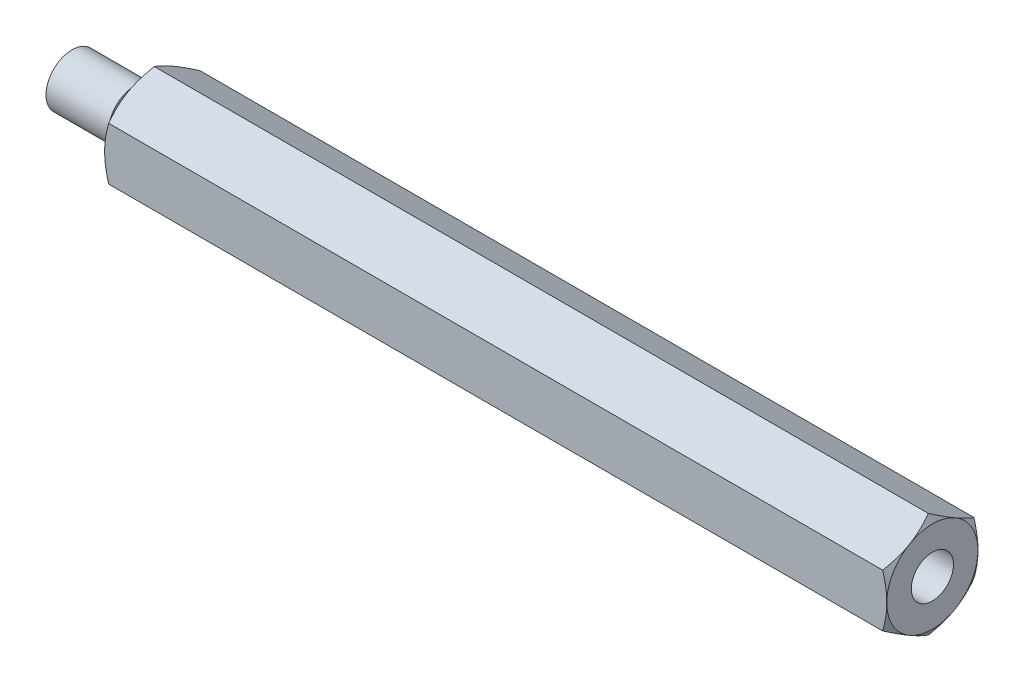
ISO-10303-21;
HEADER;
FILE_DESCRIPTION(('STEP AP214'),'2;1');
FILE_NAME('part.step','',(''),(''),'','','');
FILE_SCHEMA(('AUTOMOTIVE_DESIGN { 1 0 10303 214 1 1 1 1 }'));
ENDSEC;
DATA;
#1=APPLICATION_CONTEXT('core data for automotive mechanical design processes');
#2=APPLICATION_PROTOCOL_DEFINITION('international standard','automotive_design',2000,#1);
#3=PRODUCT_CONTEXT('',#1,'mechanical');
#4=PRODUCT('Part','Part','',(#3));
#5=PRODUCT_RELATED_PRODUCT_CATEGORY('part','',(#4));
#6=PRODUCT_DEFINITION_FORMATION('','',#4);
#7=PRODUCT_DEFINITION_CONTEXT('part definition',#1,'design');
#8=PRODUCT_DEFINITION('design','',#6,#7);
#9=PRODUCT_DEFINITION_SHAPE('','',#8);
#10=(LENGTH_UNIT() NAMED_UNIT(*) SI_UNIT(.MILLI.,.METRE.));
#11=(NAMED_UNIT(*) PLANE_ANGLE_UNIT() SI_UNIT($,.RADIAN.));
#12=(NAMED_UNIT(*) SI_UNIT($,.STERADIAN.) SOLID_ANGLE_UNIT());
#13=UNCERTAINTY_MEASURE_WITH_UNIT(LENGTH_MEASURE(1.E-05),#10,'distance_accuracy_value','');
#14=(GEOMETRIC_REPRESENTATION_CONTEXT(3) GLOBAL_UNCERTAINTY_ASSIGNED_CONTEXT((#13)) GLOBAL_UNIT_ASSIGNED_CONTEXT((#10,
#11,#12)) REPRESENTATION_CONTEXT('',''));
#15=CARTESIAN_POINT('',(0.,0.,0.));
#16=DIRECTION('',(0.,0.,1.));
#17=DIRECTION('',(1.,0.,0.));
#18=AXIS2_PLACEMENT_3D('',#15,#16,#17);
#19=CARTESIAN_POINT('',(60.,2.02072594216369,-3.5));
#20=DIRECTION('',(0.,-0.866025403784439,0.5));
#21=DIRECTION('',(0.,-0.5,-0.866025403784439));
#22=AXIS2_PLACEMENT_3D('',#19,#20,#21);
#23=PLANE('',#22);
#24=CARTESIAN_POINT('',(59.6873259393066,2.02061047210985,-3.5002));
#25=CARTESIAN_POINT('',(59.73861421101,2.10941108799267,-3.34639282154755));
#26=CARTESIAN_POINT('',(59.7852590461838,2.19897822522909,-3.19125798916558));
#27=CARTESIAN_POINT('',(59.8666781244667,2.37966345361545,-2.87830199342322));
#28=CARTESIAN_POINT('',(59.9014235644154,2.47078475532382,-2.72047526921251));
#29=CARTESIAN_POINT('',(59.9555099728172,2.65189807961073,-2.40677778961988));
#30=CARTESIAN_POINT('',(59.9752109137396,2.74186223545399,-2.25095530083931));
#31=CARTESIAN_POINT('',(59.9987298672627,2.92221386641055,-1.93857711279463));
#32=CARTESIAN_POINT('',(60.0025673554544,3.01260068598001,-1.78202254896578));
#33=CARTESIAN_POINT('',(59.994584698123,3.1814939814933,-1.48949078007902));
#34=CARTESIAN_POINT('',(59.9847245659304,3.26002573814993,-1.3534697875421));
#35=CARTESIAN_POINT('',(59.9534735331006,3.41657761679354,-1.08231397971101));
#36=CARTESIAN_POINT('',(59.9320719567142,3.49459719728457,-0.947180102315322));
#37=CARTESIAN_POINT('',(59.8785695921194,3.65147186489429,-0.675465207594819));
#38=CARTESIAN_POINT('',(59.8462420055549,3.73030709667644,-0.538918580721667));
#39=CARTESIAN_POINT('',(59.772871066192,3.88680174018324,-0.2678619070555));
#40=CARTESIAN_POINT('',(59.7318449534301,3.96446315689009,-0.133348387531464));
#41=CARTESIAN_POINT('',(59.6873259393066,4.04156735438122,0.000199999999999813));
#42=B_SPLINE_CURVE_WITH_KNOTS('',3,(#24,#25,#26,#27,#28,#29,#30,#31,#32,#33,#34,#35,#36,#37,#38,
#39,#40,#41),.UNSPECIFIED.,.F.,.F.,(4,2,2,2,2,2,2,2,4),(0.,0.554793832886251,1.11092123814983,
1.65328467083218,2.19498204478402,2.66665130850859,3.13875761298266,3.62133612600509,
4.10296698719187),.UNSPECIFIED.);
#43=CARTESIAN_POINT('',(59.6873926088304,2.0207259421637,-3.5));
#44=VERTEX_POINT('',#43);
#45=CARTESIAN_POINT('',(60.,3.03108891324554,-1.75));
#46=VERTEX_POINT('',#45);
#47=EDGE_CURVE('E331',#44,#46,#42,.T.);
#48=ORIENTED_EDGE('',*,*,#47,.F.);
#49=DIRECTION('',(-1.,0.,0.));
#50=VECTOR('',#49,1.);
#51=CARTESIAN_POINT('',(60.,2.02072594216369,-3.5));
#52=LINE('',#51,#50);
#53=CARTESIAN_POINT('',(0.312607391169639,2.0207259421637,-3.5));
#54=VERTEX_POINT('',#53);
#55=EDGE_CURVE('E265',#44,#54,#52,.T.);
#56=ORIENTED_EDGE('',*,*,#55,.T.);
#57=CARTESIAN_POINT('',(0.312674060693367,4.04156735438122,0.000199999999999298));
#58=CARTESIAN_POINT('',(0.26138578898998,3.9527667384984,-0.15360717845245));
#59=CARTESIAN_POINT('',(0.214740953816195,3.86319960126198,-0.308742010834424));
#60=CARTESIAN_POINT('',(0.133321875533347,3.68251437287562,-0.621698006576781));
#61=CARTESIAN_POINT('',(0.0985764355845602,3.59139307116725,-0.779524730787496));
#62=CARTESIAN_POINT('',(0.0444900271828355,3.41027974688034,-1.09322221038013));
#63=CARTESIAN_POINT('',(0.0247890862603813,3.32031559103708,-1.24904469916069));
#64=CARTESIAN_POINT('',(0.00127013273725456,3.13996396008052,-1.56142288720537));
#65=CARTESIAN_POINT('',(-0.00256735545443454,3.04957714051106,-1.71797745103423));
#66=CARTESIAN_POINT('',(0.00541530187697768,2.88068384499778,-2.01050921992099));
#67=CARTESIAN_POINT('',(0.0152754340696069,2.80215208834115,-2.1465302124579));
#68=CARTESIAN_POINT('',(0.0465264668994027,2.64560020969754,-2.41768602028899));
#69=CARTESIAN_POINT('',(0.0679280432857968,2.5675806292065,-2.55281989768468));
#70=CARTESIAN_POINT('',(0.121430407880575,2.41070596159679,-2.82453479240518));
#71=CARTESIAN_POINT('',(0.153757994445084,2.33187072981464,-2.96108141927833));
#72=CARTESIAN_POINT('',(0.227128933807991,2.17537608630783,-3.2321380929445));
#73=CARTESIAN_POINT('',(0.268155046569863,2.09771466960099,-3.36665161246854));
#74=CARTESIAN_POINT('',(0.312674060693366,2.02061047210985,-3.5002));
#75=B_SPLINE_CURVE_WITH_KNOTS('',3,(#57,#58,#59,#60,#61,#62,#63,#64,#65,#66,#67,#68,#69,#70,#71,
#72,#73,#74),.UNSPECIFIED.,.F.,.F.,(4,2,2,2,2,2,2,2,4),(0.,0.554793832886252,1.11092123814983,
1.65328467083218,2.19498204478403,2.6666513085086,3.13875761298267,3.62133612600509,
4.10296698719187),.UNSPECIFIED.);
#76=CARTESIAN_POINT('',(0.,3.03108891324554,-1.75));
#77=VERTEX_POINT('',#76);
#78=EDGE_CURVE('E315',#77,#54,#75,.T.);
#79=ORIENTED_EDGE('',*,*,#78,.F.);
#80=CARTESIAN_POINT('',(0.312607391169639,4.04145188432738,0.));
#81=VERTEX_POINT('',#80);
#82=EDGE_CURVE('E67',#81,#77,#75,.T.);
#83=ORIENTED_EDGE('',*,*,#82,.F.);
#84=DIRECTION('',(-1.,0.,0.));
#85=VECTOR('',#84,1.);
#86=CARTESIAN_POINT('',(60.,4.04145188432738,0.));
#87=LINE('',#86,#85);
#88=CARTESIAN_POINT('',(59.6873926088304,4.04145188432738,0.));
#89=VERTEX_POINT('',#88);
#90=EDGE_CURVE('E275',#89,#81,#87,.T.);
#91=ORIENTED_EDGE('',*,*,#90,.F.);
#92=EDGE_CURVE('E228',#46,#89,#42,.T.);
#93=ORIENTED_EDGE('',*,*,#92,.F.);
#94=EDGE_LOOP('',(#48,#56,#79,#83,#91,#93));
#95=FACE_BOUND('',#94,.T.);
#96=ADVANCED_FACE('F45',(#95),#23,.F.);
#97=CARTESIAN_POINT('',(60.,4.04145188432738,0.));
#98=DIRECTION('',(0.,-0.866025403784439,-0.5));
#99=DIRECTION('',(0.,0.5,-0.866025403784439));
#100=AXIS2_PLACEMENT_3D('',#97,#98,#99);
#101=PLANE('',#100);
#102=CARTESIAN_POINT('',(59.6873259393066,4.04156735438122,-0.000200000000000785));
#103=CARTESIAN_POINT('',(59.73861421101,3.9527667384984,0.153607178452449));
#104=CARTESIAN_POINT('',(59.7852590461838,3.86319960126198,0.308742010834423));
#105=CARTESIAN_POINT('',(59.8666781244667,3.68251437287562,0.621698006576779));
#106=CARTESIAN_POINT('',(59.9014235644154,3.59139307116725,0.779524730787492));
#107=CARTESIAN_POINT('',(59.9555099728172,3.41027974688034,1.09322221038012));
#108=CARTESIAN_POINT('',(59.9752109137396,3.32031559103708,1.24904469916069));
#109=CARTESIAN_POINT('',(59.9987298672627,3.13996396008052,1.56142288720537));
#110=CARTESIAN_POINT('',(60.0025673554544,3.04957714051107,1.71797745103422));
#111=CARTESIAN_POINT('',(59.994584698123,2.88068384499778,2.01050921992098));
#112=CARTESIAN_POINT('',(59.9847245659304,2.80215208834115,2.1465302124579));
#113=CARTESIAN_POINT('',(59.9534735331006,2.64560020969754,2.41768602028899));
#114=CARTESIAN_POINT('',(59.9320719567142,2.5675806292065,2.55281989768468));
#115=CARTESIAN_POINT('',(59.8785695921194,2.41070596159679,2.82453479240518));
#116=CARTESIAN_POINT('',(59.8462420055549,2.33187072981464,2.96108141927833));
#117=CARTESIAN_POINT('',(59.772871066192,2.17537608630783,3.2321380929445));
#118=CARTESIAN_POINT('',(59.7318449534301,2.09771466960099,3.36665161246854));
#119=CARTESIAN_POINT('',(59.6873259393066,2.02061047210985,3.5002));
#120=B_SPLINE_CURVE_WITH_KNOTS('',3,(#102,#103,#104,#105,#106,#107,#108,#109,#110,#111,#112,
#113,#114,#115,#116,#117,#118,#119),.UNSPECIFIED.,.F.,.F.,(4,2,2,2,2,2,2,2,4),(0.,
0.554793832886252,1.11092123814983,1.65328467083218,2.19498204478402,2.66665130850859,
3.13875761298267,3.62133612600509,4.10296698719187),.UNSPECIFIED.);
#121=CARTESIAN_POINT('',(60.,3.03108891324554,1.75));
#122=VERTEX_POINT('',#121);
#123=EDGE_CURVE('E226',#89,#122,#120,.T.);
#124=ORIENTED_EDGE('',*,*,#123,.F.);
#125=ORIENTED_EDGE('',*,*,#90,.T.);
#126=CARTESIAN_POINT('',(0.312674060693368,2.02061047210985,3.5002));
#127=CARTESIAN_POINT('',(0.26138578898998,2.10941108799267,3.34639282154755));
#128=CARTESIAN_POINT('',(0.214740953816195,2.19897822522909,3.19125798916558));
#129=CARTESIAN_POINT('',(0.133321875533348,2.37966345361545,2.87830199342322));
#130=CARTESIAN_POINT('',(0.0985764355845608,2.47078475532382,2.72047526921251));
#131=CARTESIAN_POINT('',(0.044490027182836,2.65189807961074,2.40677778961988));
#132=CARTESIAN_POINT('',(0.0247890862603815,2.74186223545399,2.25095530083931));
#133=CARTESIAN_POINT('',(0.00127013273725442,2.92221386641056,1.93857711279463));
#134=CARTESIAN_POINT('',(-0.00256735545443452,3.01260068598001,1.78202254896577));
#135=CARTESIAN_POINT('',(0.00541530187697779,3.1814939814933,1.48949078007901));
#136=CARTESIAN_POINT('',(0.015275434069607,3.26002573814993,1.3534697875421));
#137=CARTESIAN_POINT('',(0.046526466899403,3.41657761679354,1.08231397971101));
#138=CARTESIAN_POINT('',(0.0679280432857974,3.49459719728458,0.947180102315318));
#139=CARTESIAN_POINT('',(0.121430407880576,3.65147186489429,0.675465207594817));
#140=CARTESIAN_POINT('',(0.153757994445085,3.73030709667644,0.538918580721665));
#141=CARTESIAN_POINT('',(0.227128933807991,3.88680174018324,0.267861907055498));
#142=CARTESIAN_POINT('',(0.268155046569863,3.96446315689009,0.133348387531463));
#143=CARTESIAN_POINT('',(0.312674060693367,4.04156735438122,-0.000200000000000724));
#144=B_SPLINE_CURVE_WITH_KNOTS('',3,(#126,#127,#128,#129,#130,#131,#132,#133,#134,#135,#136,
#137,#138,#139,#140,#141,#142,#143),.UNSPECIFIED.,.F.,.F.,(4,2,2,2,2,2,2,2,4),(0.,
0.554793832886252,1.11092123814983,1.65328467083218,2.19498204478403,2.6666513085086,
3.13875761298267,3.6213361260051,4.10296698719187),.UNSPECIFIED.);
#145=CARTESIAN_POINT('',(0.,3.03108891324554,1.75));
#146=VERTEX_POINT('',#145);
#147=EDGE_CURVE('E242',#146,#81,#144,.T.);
#148=ORIENTED_EDGE('',*,*,#147,.F.);
#149=CARTESIAN_POINT('',(0.312607391169639,2.02072594216369,3.5));
#150=VERTEX_POINT('',#149);
#151=EDGE_CURVE('E249',#150,#146,#144,.T.);
#152=ORIENTED_EDGE('',*,*,#151,.F.);
#153=DIRECTION('',(-1.,0.,0.));
#154=VECTOR('',#153,1.);
#155=CARTESIAN_POINT('',(60.,2.02072594216369,3.5));
#156=LINE('',#155,#154);
#157=CARTESIAN_POINT('',(59.6873926088304,2.02072594216369,3.5));
#158=VERTEX_POINT('',#157);
#159=EDGE_CURVE('E273',#158,#150,#156,.T.);
#160=ORIENTED_EDGE('',*,*,#159,.F.);
#161=EDGE_CURVE('E221',#122,#158,#120,.T.);
#162=ORIENTED_EDGE('',*,*,#161,.F.);
#163=EDGE_LOOP('',(#124,#125,#148,#152,#160,#162));
#164=FACE_BOUND('',#163,.T.);
#165=ADVANCED_FACE('F234',(#164),#101,.F.);
#166=CARTESIAN_POINT('',(60.,2.02072594216369,3.5));
#167=DIRECTION('',(0.,0.,-1.));
#168=DIRECTION('',(0.,1.,0.));
#169=AXIS2_PLACEMENT_3D('',#166,#167,#168);
#170=PLANE('',#169);
#171=CARTESIAN_POINT('',(58.3251565314145,-5.35926299121406,3.5));
#172=CARTESIAN_POINT('',(58.399418263079,-5.20559319908842,3.5));
#173=CARTESIAN_POINT('',(58.4729417716686,-5.05156008083375,3.5));
#174=CARTESIAN_POINT('',(58.6180904965525,-4.7425707418071,3.5));
#175=CARTESIAN_POINT('',(58.6897153841787,-4.58761436682436,3.5));
#176=CARTESIAN_POINT('',(58.8310223448238,-4.27574500225542,3.5));
#177=CARTESIAN_POINT('',(58.9006909543199,-4.11882589028192,3.5));
#178=CARTESIAN_POINT('',(59.0370357377573,-3.80369792903855,3.5));
#179=CARTESIAN_POINT('',(59.1037120676805,-3.64548914750595,3.5));
#180=CARTESIAN_POINT('',(59.234068180905,-3.32556618401855,3.5));
#181=CARTESIAN_POINT('',(59.2977011263112,-3.16383281219923,3.5));
#182=CARTESIAN_POINT('',(59.4199832979105,-2.83845840945597,3.5));
#183=CARTESIAN_POINT('',(59.4786319696293,-2.67481716858826,3.5));
#184=CARTESIAN_POINT('',(59.589369720123,-2.34570278472049,3.5));
#185=CARTESIAN_POINT('',(59.6414727445642,-2.18023438248742,3.5));
#186=CARTESIAN_POINT('',(59.7374270630236,-1.8469452280637,3.5));
#187=CARTESIAN_POINT('',(59.7812809665328,-1.6791252378753,3.5));
#188=CARTESIAN_POINT('',(59.8586080544152,-1.34101828610925,3.5));
#189=CARTESIAN_POINT('',(59.892078474788,-1.17073068027693,3.5));
#190=CARTESIAN_POINT('',(59.946385043568,-0.828102385138486,3.5));
#191=CARTESIAN_POINT('',(59.9672211808048,-0.655761694017304,3.5));
#192=CARTESIAN_POINT('',(59.9944159134942,-0.311020490924454,3.5));
#193=CARTESIAN_POINT('',(60.0008661631659,-0.138627397207264,3.5));
#194=CARTESIAN_POINT('',(59.998946441922,0.206038074906529,3.5));
#195=CARTESIAN_POINT('',(59.9905803180366,0.378310473023173,3.5));
#196=CARTESIAN_POINT('',(59.9642311072131,0.672490555822327,3.5));
#197=CARTESIAN_POINT('',(59.9496793659616,0.794722791084098,3.5));
#198=CARTESIAN_POINT('',(59.9140632659466,1.03824305430562,3.5));
#199=CARTESIAN_POINT('',(59.8929978800739,1.15953093025889,3.5));
#200=CARTESIAN_POINT('',(59.8211368129185,1.52187914771353,3.5));
#201=CARTESIAN_POINT('',(59.761694724378,1.76124104212638,3.5));
#202=CARTESIAN_POINT('',(59.6591731855974,2.11940971387716,3.5));
#203=CARTESIAN_POINT('',(59.6222503009148,2.24008344316354,3.5));
#204=CARTESIAN_POINT('',(59.5447509923007,2.48017139213738,3.5));
#205=CARTESIAN_POINT('',(59.5041770883364,2.59958641795623,3.5));
#206=CARTESIAN_POINT('',(59.4202200132172,2.83665760451809,3.5));
#207=CARTESIAN_POINT('',(59.3768539399657,2.95431988203495,3.5));
#208=CARTESIAN_POINT('',(59.2875764404331,3.18873153508813,3.5));
#209=CARTESIAN_POINT('',(59.241663985407,3.30548051959477,3.5));
#210=CARTESIAN_POINT('',(59.1947296192759,3.42180736613363,3.5));
#211=B_SPLINE_CURVE_WITH_KNOTS('',3,(#171,#172,#173,#174,#175,#176,#177,#178,#179,#180,#181,
#182,#183,#184,#185,#186,#187,#188,#189,#190,#191,#192,#193,#194,#195,#196,#197,#198,#199,#200,
#201,#202,#203,#204,#205,#206,#207,#208,#209,#210),.UNSPECIFIED.,.F.,.F.,(4,2,2,2,2,2,2,2,2,2,2,
2,2,2,2,2,2,2,2,4),(0.,0.512025318465735,1.02413870177435,1.5391827031524,2.05419982499223,
2.57553975872797,3.09693761309351,3.61720506610398,4.13730766217535,4.65754858684362,
5.17778997146959,5.69470725122279,6.21149033452398,6.5805962322233,6.94976036239485,
7.68863804939856,8.06719621660485,8.44549507476769,8.82166461280109,9.19798724733422),.UNSPECIFIED.);
#212=CARTESIAN_POINT('',(60.,0.,3.5));
#213=VERTEX_POINT('',#212);
#214=EDGE_CURVE('E227',#158,#213,#211,.F.);
#215=ORIENTED_EDGE('',*,*,#214,.F.);
#216=ORIENTED_EDGE('',*,*,#159,.T.);
#217=CARTESIAN_POINT('',(1.67484346858553,-5.35926299121405,3.5));
#218=CARTESIAN_POINT('',(1.60058173692101,-5.20559319908841,3.5));
#219=CARTESIAN_POINT('',(1.52705822833145,-5.05156008083375,3.5));
#220=CARTESIAN_POINT('',(1.38190950344749,-4.7425707418071,3.5));
#221=CARTESIAN_POINT('',(1.3102846158213,-4.58761436682436,3.5));
#222=CARTESIAN_POINT('',(1.16897765517622,-4.27574500225542,3.5));
#223=CARTESIAN_POINT('',(1.09930904568014,-4.11882589028191,3.5));
#224=CARTESIAN_POINT('',(0.962964262242741,-3.80369792903855,3.5));
#225=CARTESIAN_POINT('',(0.8962879323195,-3.64548914750595,3.5));
#226=CARTESIAN_POINT('',(0.765931819095052,-3.32556618401855,3.5));
#227=CARTESIAN_POINT('',(0.702298873688851,-3.16383281219923,3.5));
#228=CARTESIAN_POINT('',(0.580016702089481,-2.83845840945597,3.5));
#229=CARTESIAN_POINT('',(0.52136803037068,-2.67481716858825,3.5));
#230=CARTESIAN_POINT('',(0.410630279877013,-2.34570278472049,3.5));
#231=CARTESIAN_POINT('',(0.358527255435851,-2.18023438248742,3.5));
#232=CARTESIAN_POINT('',(0.262572936976438,-1.84694522806369,3.5));
#233=CARTESIAN_POINT('',(0.218719033467153,-1.6791252378753,3.5));
#234=CARTESIAN_POINT('',(0.141391945584784,-1.34101828610925,3.5));
#235=CARTESIAN_POINT('',(0.10792152521197,-1.17073068027693,3.5));
#236=CARTESIAN_POINT('',(0.0536149564320495,-0.828102385138482,3.5));
#237=CARTESIAN_POINT('',(0.0327788191952359,-0.6557616940173,3.5));
#238=CARTESIAN_POINT('',(0.00558408650575672,-0.311020490924449,3.5));
#239=CARTESIAN_POINT('',(-0.000866163165910935,-0.138627397207259,3.5));
#240=CARTESIAN_POINT('',(0.00105355807794652,0.206038074906535,3.5));
#241=CARTESIAN_POINT('',(0.00941968196343208,0.378310473023179,3.5));
#242=CARTESIAN_POINT('',(0.0357688927868918,0.672490555822328,3.5));
#243=CARTESIAN_POINT('',(0.0503206340384212,0.794722791084096,3.5));
#244=CARTESIAN_POINT('',(0.085936734053356,1.03824305430561,3.5));
#245=CARTESIAN_POINT('',(0.107002119926142,1.15953093025888,3.5));
#246=CARTESIAN_POINT('',(0.178863187081454,1.5218791477135,3.5));
#247=CARTESIAN_POINT('',(0.238305275622012,1.76124104212634,3.5));
#248=CARTESIAN_POINT('',(0.340826814402558,2.11940971387712,3.5));
#249=CARTESIAN_POINT('',(0.377749699085187,2.2400834431635,3.5));
#250=CARTESIAN_POINT('',(0.455249007699299,2.48017139213732,3.5));
#251=CARTESIAN_POINT('',(0.495822911663556,2.59958641795617,3.5));
#252=CARTESIAN_POINT('',(0.57977998678276,2.83665760451803,3.5));
#253=CARTESIAN_POINT('',(0.623146060034322,2.95431988203488,3.5));
#254=CARTESIAN_POINT('',(0.712423559566875,3.18873153508805,3.5));
#255=CARTESIAN_POINT('',(0.75833601459296,3.3054805195947,3.5));
#256=CARTESIAN_POINT('',(0.805270380724081,3.42180736613355,3.5));
#257=B_SPLINE_CURVE_WITH_KNOTS('',3,(#217,#218,#219,#220,#221,#222,#223,#224,#225,#226,#227,
#228,#229,#230,#231,#232,#233,#234,#235,#236,#237,#238,#239,#240,#241,#242,#243,#244,#245,#246,
#247,#248,#249,#250,#251,#252,#253,#254,#255,#256),.UNSPECIFIED.,.F.,.F.,(4,2,2,2,2,2,2,2,2,2,2,
2,2,2,2,2,2,2,2,4),(0.,0.512025318465736,1.02413870177436,1.53918270315241,2.05419982499223,
2.57553975872797,3.09693761309352,3.61720506610399,4.13730766217536,4.65754858684363,
5.1777899714696,5.6947072512228,6.21149033452399,6.5805962322233,6.94976036239485,
7.68863804939852,8.0671962166048,8.44549507476763,8.82166461280103,9.19798724733415),.UNSPECIFIED.);
#258=CARTESIAN_POINT('',(0.,0.,3.5));
#259=VERTEX_POINT('',#258);
#260=EDGE_CURVE('E256',#259,#150,#257,.T.);
#261=ORIENTED_EDGE('',*,*,#260,.F.);
#262=CARTESIAN_POINT('',(0.312607391169639,-2.02072594216369,3.5));
#263=VERTEX_POINT('',#262);
#264=EDGE_CURVE('E263',#263,#259,#257,.T.);
#265=ORIENTED_EDGE('',*,*,#264,.F.);
#266=DIRECTION('',(-1.,0.,0.));
#267=VECTOR('',#266,1.);
#268=CARTESIAN_POINT('',(60.,-2.02072594216369,3.5));
#269=LINE('',#268,#267);
#270=CARTESIAN_POINT('',(59.6873926088304,-2.02072594216369,3.5));
#271=VERTEX_POINT('',#270);
#272=EDGE_CURVE('E271',#271,#263,#269,.T.);
#273=ORIENTED_EDGE('',*,*,#272,.F.);
#274=EDGE_CURVE('E214',#213,#271,#211,.F.);
#275=ORIENTED_EDGE('',*,*,#274,.F.);
#276=EDGE_LOOP('',(#215,#216,#261,#265,#273,#275));
#277=FACE_BOUND('',#276,.T.);
#278=ADVANCED_FACE('F237',(#277),#170,.F.);
#279=CARTESIAN_POINT('',(60.,-2.02072594216369,3.5));
#280=DIRECTION('',(0.,0.866025403784439,-0.5));
#281=DIRECTION('',(0.,0.5,0.866025403784439));
#282=AXIS2_PLACEMENT_3D('',#279,#280,#281);
#283=PLANE('',#282);
#284=CARTESIAN_POINT('',(59.6873259393066,-2.02061047210985,3.5002));
#285=CARTESIAN_POINT('',(59.73861421101,-2.10941108799267,3.34639282154755));
#286=CARTESIAN_POINT('',(59.7852590461838,-2.19897822522909,3.19125798916558));
#287=CARTESIAN_POINT('',(59.8666781244667,-2.37966345361545,2.87830199342322));
#288=CARTESIAN_POINT('',(59.9014235644154,-2.47078475532382,2.72047526921251));
#289=CARTESIAN_POINT('',(59.9555099728172,-2.65189807961073,2.40677778961988));
#290=CARTESIAN_POINT('',(59.9752109137396,-2.74186223545399,2.25095530083931));
#291=CARTESIAN_POINT('',(59.9987298672627,-2.92221386641055,1.93857711279463));
#292=CARTESIAN_POINT('',(60.0025673554544,-3.01260068598001,1.78202254896578));
#293=CARTESIAN_POINT('',(59.994584698123,-3.18149398149329,1.48949078007902));
#294=CARTESIAN_POINT('',(59.9847245659304,-3.26002573814992,1.3534697875421));
#295=CARTESIAN_POINT('',(59.9534735331006,-3.41657761679353,1.08231397971101));
#296=CARTESIAN_POINT('',(59.9320719567142,-3.49459719728457,0.947180102315321));
#297=CARTESIAN_POINT('',(59.8785695921194,-3.65147186489429,0.675465207594819));
#298=CARTESIAN_POINT('',(59.8462420055549,-3.73030709667644,0.538918580721667));
#299=CARTESIAN_POINT('',(59.772871066192,-3.88680174018324,0.2678619070555));
#300=CARTESIAN_POINT('',(59.7318449534301,-3.96446315689009,0.133348387531464));
#301=CARTESIAN_POINT('',(59.6873259393066,-4.04156735438122,-0.000200000000000246));
#302=B_SPLINE_CURVE_WITH_KNOTS('',3,(#284,#285,#286,#287,#288,#289,#290,#291,#292,#293,#294,
#295,#296,#297,#298,#299,#300,#301),.UNSPECIFIED.,.F.,.F.,(4,2,2,2,2,2,2,2,4),(0.,
0.554793832886251,1.11092123814983,1.65328467083218,2.19498204478402,2.66665130850859,
3.13875761298267,3.62133612600509,4.10296698719187),.UNSPECIFIED.);
#303=CARTESIAN_POINT('',(60.,-3.03108891324554,1.75));
#304=VERTEX_POINT('',#303);
#305=EDGE_CURVE('E380',#271,#304,#302,.T.);
#306=ORIENTED_EDGE('',*,*,#305,.F.);
#307=ORIENTED_EDGE('',*,*,#272,.T.);
#308=CARTESIAN_POINT('',(0.312674060693367,-4.04156735438122,-0.000199999999999961));
#309=CARTESIAN_POINT('',(0.26138578898998,-3.9527667384984,0.15360717845245));
#310=CARTESIAN_POINT('',(0.214740953816194,-3.86319960126198,0.308742010834424));
#311=CARTESIAN_POINT('',(0.133321875533347,-3.68251437287562,0.62169800657678));
#312=CARTESIAN_POINT('',(0.0985764355845596,-3.59139307116725,0.779524730787494));
#313=CARTESIAN_POINT('',(0.044490027182835,-3.41027974688034,1.09322221038013));
#314=CARTESIAN_POINT('',(0.0247890862603809,-3.32031559103708,1.24904469916069));
#315=CARTESIAN_POINT('',(0.00127013273725399,-3.13996396008052,1.56142288720537));
#316=CARTESIAN_POINT('',(-0.00256735545443526,-3.04957714051106,1.71797745103423));
#317=CARTESIAN_POINT('',(0.00541530187697692,-2.88068384499777,2.01050921992099));
#318=CARTESIAN_POINT('',(0.0152754340696062,-2.80215208834114,2.1465302124579));
#319=CARTESIAN_POINT('',(0.0465264668994021,-2.64560020969754,2.41768602028899));
#320=CARTESIAN_POINT('',(0.0679280432857963,-2.5675806292065,2.55281989768468));
#321=CARTESIAN_POINT('',(0.121430407880574,-2.41070596159678,2.82453479240518));
#322=CARTESIAN_POINT('',(0.153757994445084,-2.33187072981463,2.96108141927834));
#323=CARTESIAN_POINT('',(0.227128933807991,-2.17537608630783,3.2321380929445));
#324=CARTESIAN_POINT('',(0.268155046569863,-2.09771466960098,3.36665161246854));
#325=CARTESIAN_POINT('',(0.312674060693366,-2.02061047210985,3.5002));
#326=B_SPLINE_CURVE_WITH_KNOTS('',3,(#308,#309,#310,#311,#312,#313,#314,#315,#316,#317,#318,
#319,#320,#321,#322,#323,#324,#325),.UNSPECIFIED.,.F.,.F.,(4,2,2,2,2,2,2,2,4),(0.,
0.554793832886252,1.11092123814983,1.65328467083218,2.19498204478403,2.6666513085086,
3.13875761298267,3.6213361260051,4.10296698719187),.UNSPECIFIED.);
#327=CARTESIAN_POINT('',(0.,-3.03108891324554,1.75));
#328=VERTEX_POINT('',#327);
#329=EDGE_CURVE('E264',#328,#263,#326,.T.);
#330=ORIENTED_EDGE('',*,*,#329,.F.);
#331=CARTESIAN_POINT('',(0.312607391169639,-4.04145188432738,0.));
#332=VERTEX_POINT('',#331);
#333=EDGE_CURVE('E250',#332,#328,#326,.T.);
#334=ORIENTED_EDGE('',*,*,#333,.F.);
#335=DIRECTION('',(-1.,0.,0.));
#336=VECTOR('',#335,1.);
#337=CARTESIAN_POINT('',(60.,-4.04145188432738,0.));
#338=LINE('',#337,#336);
#339=CARTESIAN_POINT('',(59.6873926088304,-4.04145188432738,0.));
#340=VERTEX_POINT('',#339);
#341=EDGE_CURVE('E269',#340,#332,#338,.T.);
#342=ORIENTED_EDGE('',*,*,#341,.F.);
#343=EDGE_CURVE('E207',#304,#340,#302,.T.);
#344=ORIENTED_EDGE('',*,*,#343,.F.);
#345=EDGE_LOOP('',(#306,#307,#330,#334,#342,#344));
#346=FACE_BOUND('',#345,.T.);
#347=ADVANCED_FACE('F309',(#346),#283,.F.);
#348=CARTESIAN_POINT('',(60.,-4.04145188432738,0.));
#349=DIRECTION('',(0.,0.866025403784439,0.5));
#350=DIRECTION('',(0.,-0.5,0.866025403784439));
#351=AXIS2_PLACEMENT_3D('',#348,#349,#350);
#352=PLANE('',#351);
#353=CARTESIAN_POINT('',(59.6873259393066,-4.04156735438122,0.000200000000000223));
#354=CARTESIAN_POINT('',(59.73861421101,-3.9527667384984,-0.153607178452449));
#355=CARTESIAN_POINT('',(59.7852590461838,-3.86319960126198,-0.308742010834423));
#356=CARTESIAN_POINT('',(59.8666781244667,-3.68251437287562,-0.621698006576779));
#357=CARTESIAN_POINT('',(59.9014235644154,-3.59139307116725,-0.779524730787493));
#358=CARTESIAN_POINT('',(59.9555099728172,-3.41027974688034,-1.09322221038012));
#359=CARTESIAN_POINT('',(59.9752109137396,-3.32031559103708,-1.24904469916069));
#360=CARTESIAN_POINT('',(59.9987298672627,-3.13996396008052,-1.56142288720537));
#361=CARTESIAN_POINT('',(60.0025673554544,-3.04957714051107,-1.71797745103422));
#362=CARTESIAN_POINT('',(59.994584698123,-2.88068384499778,-2.01050921992098));
#363=CARTESIAN_POINT('',(59.9847245659304,-2.80215208834115,-2.1465302124579));
#364=CARTESIAN_POINT('',(59.9534735331006,-2.64560020969754,-2.41768602028899));
#365=CARTESIAN_POINT('',(59.9320719567142,-2.5675806292065,-2.55281989768468));
#366=CARTESIAN_POINT('',(59.8785695921194,-2.41070596159679,-2.82453479240518));
#367=CARTESIAN_POINT('',(59.8462420055549,-2.33187072981464,-2.96108141927833));
#368=CARTESIAN_POINT('',(59.772871066192,-2.17537608630783,-3.2321380929445));
#369=CARTESIAN_POINT('',(59.7318449534301,-2.09771466960099,-3.36665161246854));
#370=CARTESIAN_POINT('',(59.6873259393066,-2.02061047210985,-3.5002));
#371=B_SPLINE_CURVE_WITH_KNOTS('',3,(#353,#354,#355,#356,#357,#358,#359,#360,#361,#362,#363,
#364,#365,#366,#367,#368,#369,#370),.UNSPECIFIED.,.F.,.F.,(4,2,2,2,2,2,2,2,4),(0.,
0.554793832886251,1.11092123814983,1.65328467083218,2.19498204478402,2.66665130850859,
3.13875761298266,3.62133612600509,4.10296698719187),.UNSPECIFIED.);
#372=CARTESIAN_POINT('',(60.,-3.03108891324554,-1.75));
#373=VERTEX_POINT('',#372);
#374=EDGE_CURVE('E378',#340,#373,#371,.T.);
#375=ORIENTED_EDGE('',*,*,#374,.F.);
#376=ORIENTED_EDGE('',*,*,#341,.T.);
#377=CARTESIAN_POINT('',(0.312674060693366,-2.02061047210985,-3.5002));
#378=CARTESIAN_POINT('',(0.26138578898998,-2.10941108799267,-3.34639282154755));
#379=CARTESIAN_POINT('',(0.214740953816194,-2.19897822522909,-3.19125798916558));
#380=CARTESIAN_POINT('',(0.133321875533347,-2.37966345361545,-2.87830199342322));
#381=CARTESIAN_POINT('',(0.0985764355845603,-2.47078475532382,-2.7204752692125));
#382=CARTESIAN_POINT('',(0.0444900271828355,-2.65189807961074,-2.40677778961987));
#383=CARTESIAN_POINT('',(0.024789086260381,-2.74186223545399,-2.25095530083931));
#384=CARTESIAN_POINT('',(0.0012701327372541,-2.92221386641056,-1.93857711279463));
#385=CARTESIAN_POINT('',(-0.00256735545443485,-3.01260068598001,-1.78202254896577));
#386=CARTESIAN_POINT('',(0.00541530187697748,-3.1814939814933,-1.48949078007901));
#387=CARTESIAN_POINT('',(0.0152754340696067,-3.26002573814993,-1.3534697875421));
#388=CARTESIAN_POINT('',(0.0465264668994025,-3.41657761679354,-1.08231397971101));
#389=CARTESIAN_POINT('',(0.0679280432857968,-3.49459719728458,-0.947180102315318));
#390=CARTESIAN_POINT('',(0.121430407880575,-3.65147186489429,-0.675465207594817));
#391=CARTESIAN_POINT('',(0.153757994445084,-3.73030709667644,-0.538918580721665));
#392=CARTESIAN_POINT('',(0.227128933807991,-3.88680174018324,-0.267861907055499));
#393=CARTESIAN_POINT('',(0.268155046569863,-3.96446315689009,-0.133348387531464));
#394=CARTESIAN_POINT('',(0.312674060693366,-4.04156735438122,0.000200000000000035));
#395=B_SPLINE_CURVE_WITH_KNOTS('',3,(#377,#378,#379,#380,#381,#382,#383,#384,#385,#386,#387,
#388,#389,#390,#391,#392,#393,#394),.UNSPECIFIED.,.F.,.F.,(4,2,2,2,2,2,2,2,4),(0.,
0.554793832886252,1.11092123814983,1.65328467083218,2.19498204478403,2.6666513085086,
3.13875761298267,3.62133612600509,4.10296698719187),.UNSPECIFIED.);
#396=CARTESIAN_POINT('',(0.,-3.03108891324554,-1.75));
#397=VERTEX_POINT('',#396);
#398=EDGE_CURVE('E312',#397,#332,#395,.T.);
#399=ORIENTED_EDGE('',*,*,#398,.F.);
#400=CARTESIAN_POINT('',(0.312607391169639,-2.02072594216369,-3.5));
#401=VERTEX_POINT('',#400);
#402=EDGE_CURVE('E314',#401,#397,#395,.T.);
#403=ORIENTED_EDGE('',*,*,#402,.F.);
#404=DIRECTION('',(-1.,0.,0.));
#405=VECTOR('',#404,1.);
#406=CARTESIAN_POINT('',(60.,-2.02072594216369,-3.5));
#407=LINE('',#406,#405);
#408=CARTESIAN_POINT('',(59.6873926088304,-2.02072594216369,-3.5));
#409=VERTEX_POINT('',#408);
#410=EDGE_CURVE('E267',#409,#401,#407,.T.);
#411=ORIENTED_EDGE('',*,*,#410,.F.);
#412=EDGE_CURVE('E177',#373,#409,#371,.T.);
#413=ORIENTED_EDGE('',*,*,#412,.F.);
#414=EDGE_LOOP('',(#375,#376,#399,#403,#411,#413));
#415=FACE_BOUND('',#414,.T.);
#416=ADVANCED_FACE('F376',(#415),#352,.F.);
#417=CARTESIAN_POINT('',(60.,-2.02072594216369,-3.5));
#418=DIRECTION('',(0.,0.,1.));
#419=DIRECTION('',(0.,-1.,0.));
#420=AXIS2_PLACEMENT_3D('',#417,#418,#419);
#421=PLANE('',#420);
#422=CARTESIAN_POINT('',(58.3251559275222,-5.35926424048623,-3.5));
#423=CARTESIAN_POINT('',(58.3994176850256,-5.20559440559575,-3.5));
#424=CARTESIAN_POINT('',(58.4729412194389,-5.05156124454359,-3.5));
#425=CARTESIAN_POINT('',(58.6180899958327,-4.74257181977883,-3.5));
#426=CARTESIAN_POINT('',(58.6897149091451,-4.58761540185546,-3.5));
#427=CARTESIAN_POINT('',(58.8310219211754,-4.27574595068725,-3.5));
#428=CARTESIAN_POINT('',(58.9006905563652,-4.11882679505209,-3.5));
#429=CARTESIAN_POINT('',(59.0370353907171,-3.80369874616064,-3.5));
#430=CARTESIAN_POINT('',(59.1037117458612,-3.64548992064165,-3.5));
#431=CARTESIAN_POINT('',(59.2340679090937,-3.32556686799683,-3.5));
#432=CARTESIAN_POINT('',(59.2977008792735,-3.16383345099893,-3.5));
#433=CARTESIAN_POINT('',(59.4199830990462,-2.83845895714229,-3.5));
#434=CARTESIAN_POINT('',(59.4786317941642,-2.67481767033957,-3.5));
#435=CARTESIAN_POINT('',(59.5893695891266,-2.34570319373403,-3.5));
#436=CARTESIAN_POINT('',(59.6414726346449,-2.18023474470137,-3.5));
#437=CARTESIAN_POINT('',(59.7374269916921,-1.84694549539021,-3.5));
#438=CARTESIAN_POINT('',(59.7812809127144,-1.67912545711474,-3.5));
#439=CARTESIAN_POINT('',(59.8586080360278,-1.34101838256746,-3.5));
#440=CARTESIAN_POINT('',(59.8920784727752,-1.17073070168119,-3.5));
#441=CARTESIAN_POINT('',(59.9463850628576,-0.82810225474888,-3.5));
#442=CARTESIAN_POINT('',(59.9672212050305,-0.65576148688913,-3.5));
#443=CARTESIAN_POINT('',(59.994415934084,-0.311020130690045,-3.5));
#444=CARTESIAN_POINT('',(60.0008661752965,-0.138626960610228,-3.5));
#445=CARTESIAN_POINT('',(59.9989464240948,0.206038662929249,-3.5));
#446=CARTESIAN_POINT('',(59.9905802787077,0.378311136109268,-3.5));
#447=CARTESIAN_POINT('',(59.9642310248376,0.672491314888642,-3.5));
#448=CARTESIAN_POINT('',(59.9496792663567,0.794723571901816,-3.5));
#449=CARTESIAN_POINT('',(59.9140631309341,1.03824387771237,-3.5));
#450=CARTESIAN_POINT('',(59.8929977268829,1.15953177450313,-3.5));
#451=CARTESIAN_POINT('',(59.8211366047503,1.52188005346718,-3.5));
#452=CARTESIAN_POINT('',(59.7616944790054,1.7612419874188,-3.5));
#453=CARTESIAN_POINT('',(59.6591728851902,2.11941071826363,-3.5));
#454=CARTESIAN_POINT('',(59.6222499820301,2.24008446757479,-3.5));
#455=CARTESIAN_POINT('',(59.5447506369941,2.48017245637083,-3.5));
#456=CARTESIAN_POINT('',(59.5041767150857,2.59958750198743,-3.5));
#457=CARTESIAN_POINT('',(59.4202196047808,2.83665872785767,-3.5));
#458=CARTESIAN_POINT('',(59.3768535142872,2.9543210248865,-3.5));
#459=CARTESIAN_POINT('',(59.2875759807899,3.18873271700627,-3.5));
#460=CARTESIAN_POINT('',(59.2416635090405,3.30548172106725,-3.5));
#461=CARTESIAN_POINT('',(59.194729126443,3.42180858719348,-3.5));
#462=B_SPLINE_CURVE_WITH_KNOTS('',3,(#422,#423,#424,#425,#426,#427,#428,#429,#430,#431,#432,
#433,#434,#435,#436,#437,#438,#439,#440,#441,#442,#443,#444,#445,#446,#447,#448,#449,#450,#451,
#452,#453,#454,#455,#456,#457,#458,#459,#460,#461),.UNSPECIFIED.,.F.,.F.,(4,2,2,2,2,2,2,2,2,2,2,
2,2,2,2,2,2,2,2,4),(0.,0.512025467708519,1.02413900028468,1.53918315265711,2.05420042547922,
2.57554051253681,3.09693852027602,3.61720612610813,4.13730887487716,4.65755002944062,
5.17779164362334,5.69470915048344,6.21149246105174,6.58059842964298,6.94976263071819,
7.68864045992712,8.06719870082307,8.44549763256371,8.82166724342679,9.19798995093347),.UNSPECIFIED.);
#463=CARTESIAN_POINT('',(60.,0.,-3.5));
#464=VERTEX_POINT('',#463);
#465=EDGE_CURVE('E176',#409,#464,#462,.T.);
#466=ORIENTED_EDGE('',*,*,#465,.F.);
#467=ORIENTED_EDGE('',*,*,#410,.T.);
#468=CARTESIAN_POINT('',(1.67484407247788,-5.35926424048622,-3.5));
#469=CARTESIAN_POINT('',(1.60058231497445,-5.20559440559575,-3.5));
#470=CARTESIAN_POINT('',(1.52705878056117,-5.05156124454358,-3.5));
#471=CARTESIAN_POINT('',(1.38191000416731,-4.74257181977882,-3.5));
#472=CARTESIAN_POINT('',(1.31028509085495,-4.58761540185546,-3.5));
#473=CARTESIAN_POINT('',(1.16897807882458,-4.27574595068725,-3.5));
#474=CARTESIAN_POINT('',(1.09930944363486,-4.11882679505209,-3.5));
#475=CARTESIAN_POINT('',(0.962964609282965,-3.80369874616064,-3.5));
#476=CARTESIAN_POINT('',(0.896288254138824,-3.64548992064165,-3.5));
#477=CARTESIAN_POINT('',(0.765932090906334,-3.32556686799683,-3.5));
#478=CARTESIAN_POINT('',(0.702299120726492,-3.16383345099893,-3.5));
#479=CARTESIAN_POINT('',(0.5800169009538,-2.83845895714229,-3.5));
#480=CARTESIAN_POINT('',(0.521368205835806,-2.67481767033957,-3.5));
#481=CARTESIAN_POINT('',(0.410630410873411,-2.34570319373403,-3.5));
#482=CARTESIAN_POINT('',(0.358527365355119,-2.18023474470137,-3.5));
#483=CARTESIAN_POINT('',(0.262573008307882,-1.84694549539021,-3.5));
#484=CARTESIAN_POINT('',(0.218719087285581,-1.67912545711474,-3.5));
#485=CARTESIAN_POINT('',(0.141391963972231,-1.34101838256746,-3.5));
#486=CARTESIAN_POINT('',(0.107921527224783,-1.17073070168119,-3.5));
#487=CARTESIAN_POINT('',(0.0536149371423565,-0.828102254748878,-3.5));
#488=CARTESIAN_POINT('',(0.0327787949694585,-0.655761486889128,-3.5));
#489=CARTESIAN_POINT('',(0.00558406591599459,-0.311020130690043,-3.5));
#490=CARTESIAN_POINT('',(-0.000866175296537901,-0.138626960610225,-3.5));
#491=CARTESIAN_POINT('',(0.00105357590517515,0.206038662929253,-3.5));
#492=CARTESIAN_POINT('',(0.00941972129227812,0.378311136109272,-3.5));
#493=CARTESIAN_POINT('',(0.0357689751623773,0.672491314888643,-3.5));
#494=CARTESIAN_POINT('',(0.0503207336432889,0.794723571901813,-3.5));
#495=CARTESIAN_POINT('',(0.0859368690658883,1.03824387771236,-3.5));
#496=CARTESIAN_POINT('',(0.107002273117115,1.15953177450312,-3.5));
#497=CARTESIAN_POINT('',(0.178863395249659,1.52188005346715,-3.5));
#498=CARTESIAN_POINT('',(0.238305520994606,1.76124198741877,-3.5));
#499=CARTESIAN_POINT('',(0.340827114809808,2.11941071826359,-3.5));
#500=CARTESIAN_POINT('',(0.377750017969917,2.24008446757474,-3.5));
#501=CARTESIAN_POINT('',(0.455249363005882,2.48017245637077,-3.5));
#502=CARTESIAN_POINT('',(0.495823284914267,2.59958750198737,-3.5));
#503=CARTESIAN_POINT('',(0.57978039521915,2.8366587278576,-3.5));
#504=CARTESIAN_POINT('',(0.623146485712766,2.95432102488643,-3.5));
#505=CARTESIAN_POINT('',(0.712424019210119,3.1887327170062,-3.5));
#506=CARTESIAN_POINT('',(0.758336490959499,3.30548172106717,-3.5));
#507=CARTESIAN_POINT('',(0.805270873556989,3.4218085871934,-3.5));
#508=B_SPLINE_CURVE_WITH_KNOTS('',3,(#468,#469,#470,#471,#472,#473,#474,#475,#476,#477,#478,
#479,#480,#481,#482,#483,#484,#485,#486,#487,#488,#489,#490,#491,#492,#493,#494,#495,#496,#497,
#498,#499,#500,#501,#502,#503,#504,#505,#506,#507),.UNSPECIFIED.,.F.,.F.,(4,2,2,2,2,2,2,2,2,2,2,
2,2,2,2,2,2,2,2,4),(0.,0.512025467708518,1.02413900028468,1.53918315265711,2.05420042547922,
2.57554051253682,3.09693852027603,3.61720612610814,4.13730887487717,4.65755002944063,
5.17779164362335,5.69470915048345,6.21149246105175,6.58059842964299,6.94976263071819,
7.68864045992709,8.06719870082303,8.44549763256366,8.82166724342673,9.1979899509334),.UNSPECIFIED.);
#509=CARTESIAN_POINT('',(0.,0.,-3.5));
#510=VERTEX_POINT('',#509);
#511=EDGE_CURVE('E323',#510,#401,#508,.F.);
#512=ORIENTED_EDGE('',*,*,#511,.F.);
#513=EDGE_CURVE('E321',#54,#510,#508,.F.);
#514=ORIENTED_EDGE('',*,*,#513,.F.);
#515=ORIENTED_EDGE('',*,*,#55,.F.);
#516=EDGE_CURVE('E168',#464,#44,#462,.T.);
#517=ORIENTED_EDGE('',*,*,#516,.F.);
#518=EDGE_LOOP('',(#466,#467,#512,#514,#515,#517));
#519=FACE_BOUND('',#518,.T.);
#520=ADVANCED_FACE('F184',(#519),#421,.F.);
#521=CARTESIAN_POINT('',(0.,0.,0.));
#522=DIRECTION('',(1.,0.,0.));
#523=DIRECTION('',(0.,0.,-1.));
#524=AXIS2_PLACEMENT_3D('',#521,#522,#523);
#525=CONICAL_SURFACE('',#524,3.5,1.0471975511966);
#526=ORIENTED_EDGE('',*,*,#402,.T.);
#527=CARTESIAN_POINT('',(0.,0.,0.));
#528=DIRECTION('',(1.,0.,0.));
#529=DIRECTION('',(0.,0.,-1.));
#530=AXIS2_PLACEMENT_3D('',#527,#528,#529);
#531=CIRCLE('',#530,3.5);
#532=EDGE_CURVE('E276',#397,#510,#531,.T.);
#533=ORIENTED_EDGE('',*,*,#532,.T.);
#534=ORIENTED_EDGE('',*,*,#511,.T.);
#535=EDGE_LOOP('',(#526,#533,#534));
#536=FACE_BOUND('',#535,.T.);
#537=ADVANCED_FACE('F363',(#536),#525,.T.);
#538=ORIENTED_EDGE('',*,*,#333,.T.);
#539=EDGE_CURVE('E278',#328,#397,#531,.T.);
#540=ORIENTED_EDGE('',*,*,#539,.T.);
#541=ORIENTED_EDGE('',*,*,#398,.T.);
#542=EDGE_LOOP('',(#538,#540,#541));
#543=FACE_BOUND('',#542,.T.);
#544=ADVANCED_FACE('F362',(#543),#525,.T.);
#545=ORIENTED_EDGE('',*,*,#264,.T.);
#546=EDGE_CURVE('E285',#259,#328,#531,.T.);
#547=ORIENTED_EDGE('',*,*,#546,.T.);
#548=ORIENTED_EDGE('',*,*,#329,.T.);
#549=EDGE_LOOP('',(#545,#547,#548));
#550=FACE_BOUND('',#549,.T.);
#551=ADVANCED_FACE('F198',(#550),#525,.T.);
#552=ORIENTED_EDGE('',*,*,#260,.T.);
#553=ORIENTED_EDGE('',*,*,#151,.T.);
#554=CARTESIAN_POINT('',(0.,0.,0.));
#555=DIRECTION('',(-1.,0.,0.));
#556=DIRECTION('',(0.,0.,1.));
#557=AXIS2_PLACEMENT_3D('',#554,#555,#556);
#558=CIRCLE('',#557,3.5);
#559=EDGE_CURVE('E326',#259,#146,#558,.T.);
#560=ORIENTED_EDGE('',*,*,#559,.F.);
#561=EDGE_LOOP('',(#552,#553,#560));
#562=FACE_BOUND('',#561,.T.);
#563=ADVANCED_FACE('F354',(#562),#525,.T.);
#564=ORIENTED_EDGE('',*,*,#147,.T.);
#565=ORIENTED_EDGE('',*,*,#82,.T.);
#566=EDGE_CURVE('E286',#77,#146,#531,.T.);
#567=ORIENTED_EDGE('',*,*,#566,.T.);
#568=EDGE_LOOP('',(#564,#565,#567));
#569=FACE_BOUND('',#568,.T.);
#570=ADVANCED_FACE('F356',(#569),#525,.T.);
#571=ORIENTED_EDGE('',*,*,#78,.T.);
#572=ORIENTED_EDGE('',*,*,#513,.T.);
#573=EDGE_CURVE('E279',#510,#77,#531,.T.);
#574=ORIENTED_EDGE('',*,*,#573,.T.);
#575=EDGE_LOOP('',(#571,#572,#574));
#576=FACE_BOUND('',#575,.T.);
#577=ADVANCED_FACE('F361',(#576),#525,.T.);
#578=CARTESIAN_POINT('',(0.,0.,0.));
#579=DIRECTION('',(1.,0.,0.));
#580=DIRECTION('',(0.,0.,-1.));
#581=AXIS2_PLACEMENT_3D('',#578,#579,#580);
#582=PLANE('',#581);
#583=CARTESIAN_POINT('',(0.,0.,0.));
#584=DIRECTION('',(1.,0.,0.));
#585=DIRECTION('',(0.,1.,0.));
#586=AXIS2_PLACEMENT_3D('',#583,#584,#585);
#587=CIRCLE('',#586,1.6);
#588=CARTESIAN_POINT('',(0.,1.6,0.));
#589=VERTEX_POINT('',#588);
#590=EDGE_CURVE('E162',#589,#589,#587,.T.);
#591=ORIENTED_EDGE('',*,*,#590,.T.);
#592=EDGE_LOOP('',(#591));
#593=FACE_BOUND('',#592,.T.);
#594=ORIENTED_EDGE('',*,*,#573,.F.);
#595=ORIENTED_EDGE('',*,*,#532,.F.);
#596=ORIENTED_EDGE('',*,*,#539,.F.);
#597=ORIENTED_EDGE('',*,*,#546,.F.);
#598=ORIENTED_EDGE('',*,*,#559,.T.);
#599=ORIENTED_EDGE('',*,*,#566,.F.);
#600=EDGE_LOOP('',(#594,#595,#596,#597,#598,#599));
#601=FACE_BOUND('',#600,.T.);
#602=ADVANCED_FACE('F302',(#593,#601),#582,.F.);
#603=CARTESIAN_POINT('',(59.6873926088304,0.,0.));
#604=DIRECTION('',(-1.,0.,0.));
#605=DIRECTION('',(0.,0.,1.));
#606=AXIS2_PLACEMENT_3D('',#603,#604,#605);
#607=CONICAL_SURFACE('',#606,4.04145188432738,1.04719755119662);
#608=ORIENTED_EDGE('',*,*,#412,.T.);
#609=ORIENTED_EDGE('',*,*,#465,.T.);
#610=CARTESIAN_POINT('',(60.,0.,0.));
#611=DIRECTION('',(1.,0.,0.));
#612=DIRECTION('',(0.,0.,-1.));
#613=AXIS2_PLACEMENT_3D('',#610,#611,#612);
#614=CIRCLE('',#613,3.5);
#615=EDGE_CURVE('E49',#373,#464,#614,.T.);
#616=ORIENTED_EDGE('',*,*,#615,.F.);
#617=EDGE_LOOP('',(#608,#609,#616));
#618=FACE_BOUND('',#617,.T.);
#619=ADVANCED_FACE('F195',(#618),#607,.T.);
#620=ORIENTED_EDGE('',*,*,#343,.T.);
#621=ORIENTED_EDGE('',*,*,#374,.T.);
#622=EDGE_CURVE('E290',#304,#373,#614,.T.);
#623=ORIENTED_EDGE('',*,*,#622,.F.);
#624=EDGE_LOOP('',(#620,#621,#623));
#625=FACE_BOUND('',#624,.T.);
#626=ADVANCED_FACE('F384',(#625),#607,.T.);
#627=ORIENTED_EDGE('',*,*,#274,.T.);
#628=ORIENTED_EDGE('',*,*,#305,.T.);
#629=EDGE_CURVE('E349',#213,#304,#614,.T.);
#630=ORIENTED_EDGE('',*,*,#629,.F.);
#631=EDGE_LOOP('',(#627,#628,#630));
#632=FACE_BOUND('',#631,.T.);
#633=ADVANCED_FACE('F386',(#632),#607,.T.);
#634=ORIENTED_EDGE('',*,*,#161,.T.);
#635=ORIENTED_EDGE('',*,*,#214,.T.);
#636=CARTESIAN_POINT('',(60.,0.,0.));
#637=DIRECTION('',(-1.,0.,0.));
#638=DIRECTION('',(0.,0.,1.));
#639=AXIS2_PLACEMENT_3D('',#636,#637,#638);
#640=CIRCLE('',#639,3.5);
#641=EDGE_CURVE('E165',#213,#122,#640,.T.);
#642=ORIENTED_EDGE('',*,*,#641,.T.);
#643=EDGE_LOOP('',(#634,#635,#642));
#644=FACE_BOUND('',#643,.T.);
#645=ADVANCED_FACE('F344',(#644),#607,.T.);
#646=ORIENTED_EDGE('',*,*,#92,.T.);
#647=ORIENTED_EDGE('',*,*,#123,.T.);
#648=EDGE_CURVE('E54',#46,#122,#614,.T.);
#649=ORIENTED_EDGE('',*,*,#648,.F.);
#650=EDGE_LOOP('',(#646,#647,#649));
#651=FACE_BOUND('',#650,.T.);
#652=ADVANCED_FACE('F193',(#651),#607,.T.);
#653=ORIENTED_EDGE('',*,*,#47,.T.);
#654=EDGE_CURVE('E11',#464,#46,#614,.T.);
#655=ORIENTED_EDGE('',*,*,#654,.F.);
#656=ORIENTED_EDGE('',*,*,#516,.T.);
#657=EDGE_LOOP('',(#653,#655,#656));
#658=FACE_BOUND('',#657,.T.);
#659=ADVANCED_FACE('F187',(#658),#607,.T.);
#660=CARTESIAN_POINT('',(60.,0.,0.));
#661=DIRECTION('',(1.,0.,0.));
#662=DIRECTION('',(0.,0.,-1.));
#663=AXIS2_PLACEMENT_3D('',#660,#661,#662);
#664=PLANE('',#663);
#665=CARTESIAN_POINT('',(60.,0.,0.));
#666=DIRECTION('',(1.,0.,0.));
#667=DIRECTION('',(0.,0.,-1.));
#668=AXIS2_PLACEMENT_3D('',#665,#666,#667);
#669=CIRCLE('',#668,1.621);
#670=CARTESIAN_POINT('',(60.,0.,-1.621));
#671=VERTEX_POINT('',#670);
#672=EDGE_CURVE('E149',#671,#671,#669,.T.);
#673=ORIENTED_EDGE('',*,*,#672,.F.);
#674=EDGE_LOOP('',(#673));
#675=FACE_BOUND('',#674,.T.);
#676=ORIENTED_EDGE('',*,*,#615,.T.);
#677=ORIENTED_EDGE('',*,*,#654,.T.);
#678=ORIENTED_EDGE('',*,*,#648,.T.);
#679=ORIENTED_EDGE('',*,*,#641,.F.);
#680=ORIENTED_EDGE('',*,*,#629,.T.);
#681=ORIENTED_EDGE('',*,*,#622,.T.);
#682=EDGE_LOOP('',(#676,#677,#678,#679,#680,#681));
#683=FACE_BOUND('',#682,.T.);
#684=ADVANCED_FACE('F192',(#675,#683),#664,.T.);
#685=CARTESIAN_POINT('',(0.,0.,0.));
#686=DIRECTION('',(1.,0.,0.));
#687=DIRECTION('',(0.,1.,0.));
#688=AXIS2_PLACEMENT_3D('',#685,#686,#687);
#689=CYLINDRICAL_SURFACE('',#688,1.6);
#690=CARTESIAN_POINT('',(-1.2,0.,0.));
#691=DIRECTION('',(1.,0.,0.));
#692=DIRECTION('',(0.,1.,0.));
#693=AXIS2_PLACEMENT_3D('',#690,#691,#692);
#694=CIRCLE('',#693,1.6);
#695=CARTESIAN_POINT('',(-1.2,1.6,0.));
#696=VERTEX_POINT('',#695);
#697=EDGE_CURVE('E159',#696,#696,#694,.T.);
#698=ORIENTED_EDGE('',*,*,#697,.T.);
#699=EDGE_LOOP('',(#698));
#700=FACE_BOUND('',#699,.T.);
#701=ORIENTED_EDGE('',*,*,#590,.F.);
#702=EDGE_LOOP('',(#701));
#703=FACE_BOUND('',#702,.T.);
#704=ADVANCED_FACE('F196',(#700,#703),#689,.T.);
#705=CARTESIAN_POINT('',(-1.2,1.6,0.));
#706=DIRECTION('',(1.,0.,0.));
#707=DIRECTION('',(0.,1.,0.));
#708=AXIS2_PLACEMENT_3D('',#705,#706,#707);
#709=PLANE('',#708);
#710=CARTESIAN_POINT('',(-1.2,0.,0.));
#711=DIRECTION('',(1.,0.,0.));
#712=DIRECTION('',(0.,1.,0.));
#713=AXIS2_PLACEMENT_3D('',#710,#711,#712);
#714=CIRCLE('',#713,2.);
#715=CARTESIAN_POINT('',(-1.2,2.,0.));
#716=VERTEX_POINT('',#715);
#717=EDGE_CURVE('E152',#716,#716,#714,.T.);
#718=ORIENTED_EDGE('',*,*,#717,.T.);
#719=EDGE_LOOP('',(#718));
#720=FACE_BOUND('',#719,.T.);
#721=ORIENTED_EDGE('',*,*,#697,.F.);
#722=EDGE_LOOP('',(#721));
#723=FACE_BOUND('',#722,.T.);
#724=ADVANCED_FACE('F405',(#720,#723),#709,.T.);
#725=CARTESIAN_POINT('',(0.,0.,0.));
#726=DIRECTION('',(1.,0.,0.));
#727=DIRECTION('',(0.,1.,0.));
#728=AXIS2_PLACEMENT_3D('',#725,#726,#727);
#729=CYLINDRICAL_SURFACE('',#728,2.);
#730=CARTESIAN_POINT('',(-6.,0.,0.));
#731=DIRECTION('',(1.,0.,0.));
#732=DIRECTION('',(0.,1.,0.));
#733=AXIS2_PLACEMENT_3D('',#730,#731,#732);
#734=CIRCLE('',#733,2.);
#735=CARTESIAN_POINT('',(-6.,2.,0.));
#736=VERTEX_POINT('',#735);
#737=EDGE_CURVE('E148',#736,#736,#734,.T.);
#738=ORIENTED_EDGE('',*,*,#737,.T.);
#739=EDGE_LOOP('',(#738));
#740=FACE_BOUND('',#739,.T.);
#741=ORIENTED_EDGE('',*,*,#717,.F.);
#742=EDGE_LOOP('',(#741));
#743=FACE_BOUND('',#742,.T.);
#744=ADVANCED_FACE('F415',(#740,#743),#729,.T.);
#745=CARTESIAN_POINT('',(-6.,2.,0.));
#746=DIRECTION('',(-1.,0.,0.));
#747=DIRECTION('',(0.,-1.,0.));
#748=AXIS2_PLACEMENT_3D('',#745,#746,#747);
#749=PLANE('',#748);
#750=ORIENTED_EDGE('',*,*,#737,.F.);
#751=EDGE_LOOP('',(#750));
#752=FACE_BOUND('',#751,.T.);
#753=ADVANCED_FACE('F142',(#752),#749,.T.);
#754=CARTESIAN_POINT('',(49.9,0.,0.));
#755=DIRECTION('',(1.,0.,0.));
#756=DIRECTION('',(0.,0.,-1.));
#757=AXIS2_PLACEMENT_3D('',#754,#755,#756);
#758=CONICAL_SURFACE('',#757,1.621,1.02974425867665);
#759=CARTESIAN_POINT('',(48.9260049365563,0.,0.));
#760=VERTEX_POINT('',#759);
#761=VERTEX_LOOP('',#760);
#762=FACE_BOUND('',#761,.T.);
#763=CARTESIAN_POINT('',(49.9,0.,0.));
#764=DIRECTION('',(1.,0.,0.));
#765=DIRECTION('',(0.,0.,-1.));
#766=AXIS2_PLACEMENT_3D('',#763,#764,#765);
#767=CIRCLE('',#766,1.621);
#768=CARTESIAN_POINT('',(49.9,0.,-1.621));
#769=VERTEX_POINT('',#768);
#770=EDGE_CURVE('E146',#769,#769,#767,.T.);
#771=ORIENTED_EDGE('',*,*,#770,.T.);
#772=EDGE_LOOP('',(#771));
#773=FACE_BOUND('',#772,.T.);
#774=ADVANCED_FACE('F138',(#762,#773),#758,.F.);
#775=CARTESIAN_POINT('',(60.,0.,0.));
#776=DIRECTION('',(1.,0.,0.));
#777=DIRECTION('',(0.,0.,-1.));
#778=AXIS2_PLACEMENT_3D('',#775,#776,#777);
#779=CYLINDRICAL_SURFACE('',#778,1.621);
#780=ORIENTED_EDGE('',*,*,#770,.F.);
#781=EDGE_LOOP('',(#780));
#782=FACE_BOUND('',#781,.T.);
#783=ORIENTED_EDGE('',*,*,#672,.T.);
#784=EDGE_LOOP('',(#783));
#785=FACE_BOUND('',#784,.T.);
#786=ADVANCED_FACE('F141',(#782,#785),#779,.F.);
#787=CLOSED_SHELL('',(#96,#165,#278,#347,#416,#520,#537,#544,#551,#563,#570,#577,#602,#619,#626,
#633,#645,#652,#659,#684,#704,#724,#744,#753,#774,#786));
#788=MANIFOLD_SOLID_BREP('B2',#787);
#789=ADVANCED_BREP_SHAPE_REPRESENTATION('',(#18,#788),#14);
#790=SHAPE_DEFINITION_REPRESENTATION(#9,#789);
ENDSEC;
END-ISO-10303-21;
